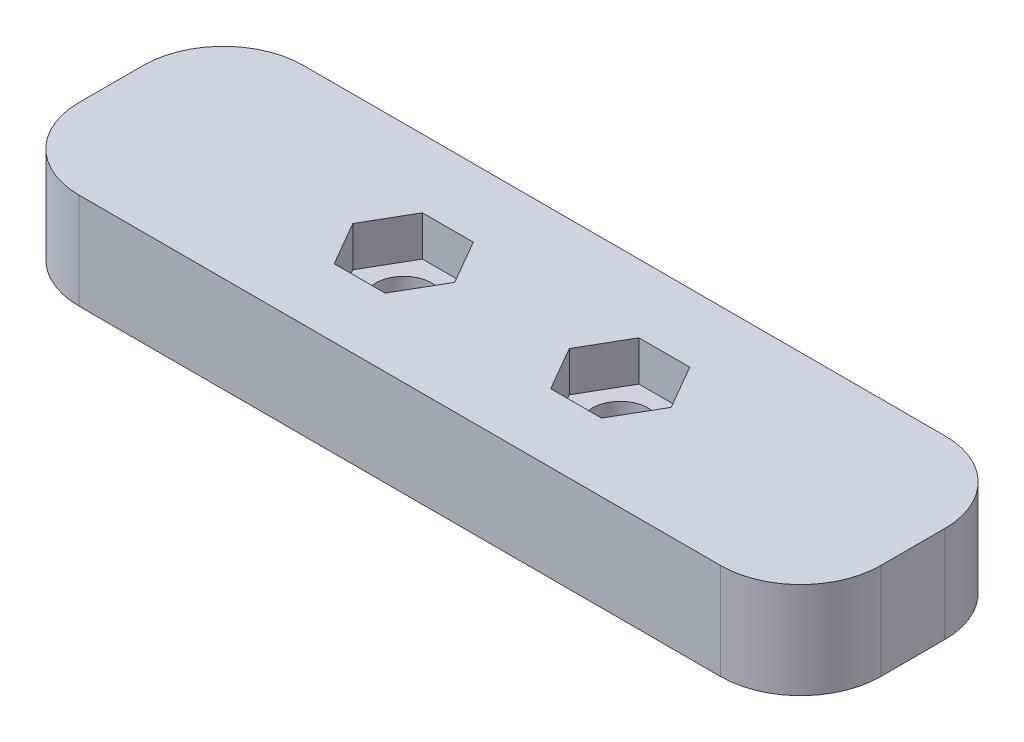
ISO-10303-21;
HEADER;
FILE_DESCRIPTION(('STEP AP214'),'2;1');
FILE_NAME('part.step','',(''),(''),'','','');
FILE_SCHEMA(('AUTOMOTIVE_DESIGN { 1 0 10303 214 1 1 1 1 }'));
ENDSEC;
DATA;
#1=APPLICATION_CONTEXT('core data for automotive mechanical design processes');
#2=APPLICATION_PROTOCOL_DEFINITION('international standard','automotive_design',2000,#1);
#3=PRODUCT_CONTEXT('',#1,'mechanical');
#4=PRODUCT('Part','Part','',(#3));
#5=PRODUCT_RELATED_PRODUCT_CATEGORY('part','',(#4));
#6=PRODUCT_DEFINITION_FORMATION('','',#4);
#7=PRODUCT_DEFINITION_CONTEXT('part definition',#1,'design');
#8=PRODUCT_DEFINITION('design','',#6,#7);
#9=PRODUCT_DEFINITION_SHAPE('','',#8);
#10=(LENGTH_UNIT() NAMED_UNIT(*) SI_UNIT(.MILLI.,.METRE.));
#11=(NAMED_UNIT(*) PLANE_ANGLE_UNIT() SI_UNIT($,.RADIAN.));
#12=(NAMED_UNIT(*) SI_UNIT($,.STERADIAN.) SOLID_ANGLE_UNIT());
#13=UNCERTAINTY_MEASURE_WITH_UNIT(LENGTH_MEASURE(1.E-05),#10,'distance_accuracy_value','');
#14=(GEOMETRIC_REPRESENTATION_CONTEXT(3) GLOBAL_UNCERTAINTY_ASSIGNED_CONTEXT((#13)) GLOBAL_UNIT_ASSIGNED_CONTEXT((#10,
#11,#12)) REPRESENTATION_CONTEXT('',''));
#15=CARTESIAN_POINT('',(0.,0.,0.));
#16=DIRECTION('',(0.,0.,1.));
#17=DIRECTION('',(1.,0.,0.));
#18=AXIS2_PLACEMENT_3D('',#15,#16,#17);
#19=CARTESIAN_POINT('',(18.25,6.,-7.));
#20=DIRECTION('',(0.,-1.,0.));
#21=DIRECTION('',(0.,0.,-1.));
#22=AXIS2_PLACEMENT_3D('',#19,#20,#21);
#23=CYLINDRICAL_SURFACE('',#22,1.75);
#24=CARTESIAN_POINT('',(18.25,0.,-7.));
#25=DIRECTION('',(0.,1.,0.));
#26=DIRECTION('',(0.,0.,1.));
#27=AXIS2_PLACEMENT_3D('',#24,#25,#26);
#28=CIRCLE('',#27,1.75);
#29=CARTESIAN_POINT('',(18.25,0.,-5.25));
#30=VERTEX_POINT('',#29);
#31=EDGE_CURVE('E276',#30,#30,#28,.T.);
#32=ORIENTED_EDGE('',*,*,#31,.F.);
#33=EDGE_LOOP('',(#32));
#34=FACE_BOUND('',#33,.T.);
#35=CARTESIAN_POINT('',(18.25,3.5,-7.));
#36=DIRECTION('',(0.,1.,0.));
#37=DIRECTION('',(0.,0.,1.));
#38=AXIS2_PLACEMENT_3D('',#35,#36,#37);
#39=CIRCLE('',#38,1.75);
#40=CARTESIAN_POINT('',(18.25,3.5,-5.25));
#41=VERTEX_POINT('',#40);
#42=EDGE_CURVE('E37',#41,#41,#39,.T.);
#43=ORIENTED_EDGE('',*,*,#42,.T.);
#44=EDGE_LOOP('',(#43));
#45=FACE_BOUND('',#44,.T.);
#46=ADVANCED_FACE('F33',(#34,#45),#23,.F.);
#47=CARTESIAN_POINT('',(31.75,6.,-7.));
#48=DIRECTION('',(0.,-1.,0.));
#49=DIRECTION('',(0.,0.,-1.));
#50=AXIS2_PLACEMENT_3D('',#47,#48,#49);
#51=CYLINDRICAL_SURFACE('',#50,1.75);
#52=CARTESIAN_POINT('',(31.75,0.,-7.));
#53=DIRECTION('',(0.,1.,0.));
#54=DIRECTION('',(0.,0.,1.));
#55=AXIS2_PLACEMENT_3D('',#52,#53,#54);
#56=CIRCLE('',#55,1.75);
#57=CARTESIAN_POINT('',(31.75,0.,-5.25));
#58=VERTEX_POINT('',#57);
#59=EDGE_CURVE('E273',#58,#58,#56,.T.);
#60=ORIENTED_EDGE('',*,*,#59,.F.);
#61=EDGE_LOOP('',(#60));
#62=FACE_BOUND('',#61,.T.);
#63=CARTESIAN_POINT('',(31.75,3.5,-7.));
#64=DIRECTION('',(0.,1.,0.));
#65=DIRECTION('',(0.,0.,1.));
#66=AXIS2_PLACEMENT_3D('',#63,#64,#65);
#67=CIRCLE('',#66,1.75);
#68=CARTESIAN_POINT('',(31.75,3.5,-5.25));
#69=VERTEX_POINT('',#68);
#70=EDGE_CURVE('E220',#69,#69,#67,.T.);
#71=ORIENTED_EDGE('',*,*,#70,.T.);
#72=EDGE_LOOP('',(#71));
#73=FACE_BOUND('',#72,.T.);
#74=ADVANCED_FACE('F348',(#62,#73),#51,.F.);
#75=CARTESIAN_POINT('',(5.,6.,-5.));
#76=DIRECTION('',(0.,1.,0.));
#77=DIRECTION('',(0.,0.,1.));
#78=AXIS2_PLACEMENT_3D('',#75,#76,#77);
#79=PLANE('',#78);
#80=DIRECTION('',(1.,0.,0.));
#81=VECTOR('',#80,1.);
#82=CARTESIAN_POINT('',(16.6622867597285,6.,-4.25));
#83=LINE('',#82,#81);
#84=CARTESIAN_POINT('',(16.6622867597285,6.,-4.25));
#85=VERTEX_POINT('',#84);
#86=CARTESIAN_POINT('',(19.8377132402715,6.,-4.25));
#87=VERTEX_POINT('',#86);
#88=EDGE_CURVE('E50',#85,#87,#83,.T.);
#89=ORIENTED_EDGE('',*,*,#88,.F.);
#90=DIRECTION('',(0.5,0.,0.866025403784439));
#91=VECTOR('',#90,1.);
#92=CARTESIAN_POINT('',(15.0745735194571,6.,-7.));
#93=LINE('',#92,#91);
#94=CARTESIAN_POINT('',(15.0745735194571,6.,-7.));
#95=VERTEX_POINT('',#94);
#96=EDGE_CURVE('E193',#95,#85,#93,.T.);
#97=ORIENTED_EDGE('',*,*,#96,.F.);
#98=DIRECTION('',(-0.5,0.,0.866025403784439));
#99=VECTOR('',#98,1.);
#100=CARTESIAN_POINT('',(16.6622867597285,6.,-9.75000000000001));
#101=LINE('',#100,#99);
#102=CARTESIAN_POINT('',(16.6622867597285,6.,-9.75000000000001));
#103=VERTEX_POINT('',#102);
#104=EDGE_CURVE('E196',#103,#95,#101,.T.);
#105=ORIENTED_EDGE('',*,*,#104,.F.);
#106=DIRECTION('',(-1.,0.,0.));
#107=VECTOR('',#106,1.);
#108=CARTESIAN_POINT('',(19.8377132402715,6.,-9.75000000000001));
#109=LINE('',#108,#107);
#110=CARTESIAN_POINT('',(19.8377132402715,6.,-9.75000000000001));
#111=VERTEX_POINT('',#110);
#112=EDGE_CURVE('E213',#111,#103,#109,.T.);
#113=ORIENTED_EDGE('',*,*,#112,.F.);
#114=DIRECTION('',(-0.5,0.,-0.866025403784439));
#115=VECTOR('',#114,1.);
#116=CARTESIAN_POINT('',(21.4254264805429,6.,-7.));
#117=LINE('',#116,#115);
#118=CARTESIAN_POINT('',(21.4254264805429,6.,-7.));
#119=VERTEX_POINT('',#118);
#120=EDGE_CURVE('E210',#119,#111,#117,.T.);
#121=ORIENTED_EDGE('',*,*,#120,.F.);
#122=DIRECTION('',(0.5,0.,-0.866025403784439));
#123=VECTOR('',#122,1.);
#124=CARTESIAN_POINT('',(19.8377132402715,6.,-4.25));
#125=LINE('',#124,#123);
#126=EDGE_CURVE('E207',#87,#119,#125,.T.);
#127=ORIENTED_EDGE('',*,*,#126,.F.);
#128=EDGE_LOOP('',(#89,#97,#105,#113,#121,#127));
#129=FACE_BOUND('',#128,.T.);
#130=DIRECTION('',(1.,0.,0.));
#131=VECTOR('',#130,1.);
#132=CARTESIAN_POINT('',(30.1622867597285,6.,-4.25));
#133=LINE('',#132,#131);
#134=CARTESIAN_POINT('',(30.1622867597285,6.,-4.25));
#135=VERTEX_POINT('',#134);
#136=CARTESIAN_POINT('',(33.3377132402715,6.,-4.25));
#137=VERTEX_POINT('',#136);
#138=EDGE_CURVE('E58',#135,#137,#133,.T.);
#139=ORIENTED_EDGE('',*,*,#138,.F.);
#140=DIRECTION('',(0.5,0.,0.866025403784439));
#141=VECTOR('',#140,1.);
#142=CARTESIAN_POINT('',(28.5745735194571,6.,-7.));
#143=LINE('',#142,#141);
#144=CARTESIAN_POINT('',(28.5745735194571,6.,-7.));
#145=VERTEX_POINT('',#144);
#146=EDGE_CURVE('E232',#145,#135,#143,.T.);
#147=ORIENTED_EDGE('',*,*,#146,.F.);
#148=DIRECTION('',(-0.5,0.,0.866025403784439));
#149=VECTOR('',#148,1.);
#150=CARTESIAN_POINT('',(30.1622867597285,6.,-9.75));
#151=LINE('',#150,#149);
#152=CARTESIAN_POINT('',(30.1622867597285,6.,-9.75));
#153=VERTEX_POINT('',#152);
#154=EDGE_CURVE('E258',#153,#145,#151,.T.);
#155=ORIENTED_EDGE('',*,*,#154,.F.);
#156=DIRECTION('',(-1.,0.,0.));
#157=VECTOR('',#156,1.);
#158=CARTESIAN_POINT('',(33.3377132402715,6.,-9.75));
#159=LINE('',#158,#157);
#160=CARTESIAN_POINT('',(33.3377132402715,6.,-9.75));
#161=VERTEX_POINT('',#160);
#162=EDGE_CURVE('E255',#161,#153,#159,.T.);
#163=ORIENTED_EDGE('',*,*,#162,.F.);
#164=DIRECTION('',(-0.500000000000001,0.,-0.866025403784438));
#165=VECTOR('',#164,1.);
#166=CARTESIAN_POINT('',(34.9254264805429,6.,-6.99999999999999));
#167=LINE('',#166,#165);
#168=CARTESIAN_POINT('',(34.9254264805429,6.,-6.99999999999999));
#169=VERTEX_POINT('',#168);
#170=EDGE_CURVE('E252',#169,#161,#167,.T.);
#171=ORIENTED_EDGE('',*,*,#170,.F.);
#172=DIRECTION('',(0.500000000000001,0.,-0.866025403784438));
#173=VECTOR('',#172,1.);
#174=CARTESIAN_POINT('',(33.3377132402715,6.,-4.25));
#175=LINE('',#174,#173);
#176=EDGE_CURVE('E249',#137,#169,#175,.T.);
#177=ORIENTED_EDGE('',*,*,#176,.F.);
#178=EDGE_LOOP('',(#139,#147,#155,#163,#171,#177));
#179=FACE_BOUND('',#178,.T.);
#180=CARTESIAN_POINT('',(5.,6.,-5.));
#181=DIRECTION('',(0.,1.,0.));
#182=DIRECTION('',(0.,0.,1.));
#183=AXIS2_PLACEMENT_3D('',#180,#181,#182);
#184=CIRCLE('',#183,5.);
#185=CARTESIAN_POINT('',(0.,6.,-5.00000000000004));
#186=VERTEX_POINT('',#185);
#187=CARTESIAN_POINT('',(5.00000000000004,6.,0.));
#188=VERTEX_POINT('',#187);
#189=EDGE_CURVE('E280',#186,#188,#184,.T.);
#190=ORIENTED_EDGE('',*,*,#189,.T.);
#191=DIRECTION('',(1.,0.,0.));
#192=VECTOR('',#191,1.);
#193=CARTESIAN_POINT('',(5.00000000000004,6.,0.));
#194=LINE('',#193,#192);
#195=CARTESIAN_POINT('',(45.,6.,0.));
#196=VERTEX_POINT('',#195);
#197=EDGE_CURVE('E283',#188,#196,#194,.T.);
#198=ORIENTED_EDGE('',*,*,#197,.T.);
#199=CARTESIAN_POINT('',(45.,6.,-5.));
#200=DIRECTION('',(0.,1.,0.));
#201=DIRECTION('',(0.,0.,-1.));
#202=AXIS2_PLACEMENT_3D('',#199,#200,#201);
#203=CIRCLE('',#202,5.);
#204=CARTESIAN_POINT('',(50.,6.,-5.00000000000004));
#205=VERTEX_POINT('',#204);
#206=EDGE_CURVE('E286',#196,#205,#203,.T.);
#207=ORIENTED_EDGE('',*,*,#206,.T.);
#208=DIRECTION('',(0.,0.,-1.));
#209=VECTOR('',#208,1.);
#210=CARTESIAN_POINT('',(50.,6.,-5.00000000000004));
#211=LINE('',#210,#209);
#212=CARTESIAN_POINT('',(50.,6.,-9.));
#213=VERTEX_POINT('',#212);
#214=EDGE_CURVE('E288',#205,#213,#211,.T.);
#215=ORIENTED_EDGE('',*,*,#214,.T.);
#216=CARTESIAN_POINT('',(45.,6.,-9.));
#217=DIRECTION('',(0.,1.,0.));
#218=DIRECTION('',(0.,0.,-1.));
#219=AXIS2_PLACEMENT_3D('',#216,#217,#218);
#220=CIRCLE('',#219,5.);
#221=CARTESIAN_POINT('',(45.,6.,-14.));
#222=VERTEX_POINT('',#221);
#223=EDGE_CURVE('E290',#213,#222,#220,.T.);
#224=ORIENTED_EDGE('',*,*,#223,.T.);
#225=DIRECTION('',(-1.,0.,0.));
#226=VECTOR('',#225,1.);
#227=CARTESIAN_POINT('',(5.,6.,-14.));
#228=LINE('',#227,#226);
#229=CARTESIAN_POINT('',(5.,6.,-14.));
#230=VERTEX_POINT('',#229);
#231=EDGE_CURVE('E292',#222,#230,#228,.T.);
#232=ORIENTED_EDGE('',*,*,#231,.T.);
#233=CARTESIAN_POINT('',(5.,6.,-9.));
#234=DIRECTION('',(0.,1.,0.));
#235=DIRECTION('',(0.,0.,-1.));
#236=AXIS2_PLACEMENT_3D('',#233,#234,#235);
#237=CIRCLE('',#236,5.);
#238=CARTESIAN_POINT('',(0.,6.,-9.));
#239=VERTEX_POINT('',#238);
#240=EDGE_CURVE('E294',#230,#239,#237,.T.);
#241=ORIENTED_EDGE('',*,*,#240,.T.);
#242=DIRECTION('',(0.,0.,1.));
#243=VECTOR('',#242,1.);
#244=CARTESIAN_POINT('',(0.,6.,-5.00000000000004));
#245=LINE('',#244,#243);
#246=EDGE_CURVE('E296',#239,#186,#245,.T.);
#247=ORIENTED_EDGE('',*,*,#246,.T.);
#248=EDGE_LOOP('',(#190,#198,#207,#215,#224,#232,#241,#247));
#249=FACE_BOUND('',#248,.T.);
#250=ADVANCED_FACE('F354',(#129,#179,#249),#79,.T.);
#251=CARTESIAN_POINT('',(5.,0.,-5.));
#252=DIRECTION('',(0.,1.,0.));
#253=DIRECTION('',(0.,0.,1.));
#254=AXIS2_PLACEMENT_3D('',#251,#252,#253);
#255=PLANE('',#254);
#256=CARTESIAN_POINT('',(5.,0.,-5.));
#257=DIRECTION('',(0.,1.,0.));
#258=DIRECTION('',(0.,0.,1.));
#259=AXIS2_PLACEMENT_3D('',#256,#257,#258);
#260=CIRCLE('',#259,5.);
#261=CARTESIAN_POINT('',(0.,0.,-5.00000000000004));
#262=VERTEX_POINT('',#261);
#263=CARTESIAN_POINT('',(5.00000000000004,0.,0.));
#264=VERTEX_POINT('',#263);
#265=EDGE_CURVE('E279',#262,#264,#260,.T.);
#266=ORIENTED_EDGE('',*,*,#265,.F.);
#267=DIRECTION('',(0.,0.,1.));
#268=VECTOR('',#267,1.);
#269=CARTESIAN_POINT('',(0.,0.,-5.00000000000004));
#270=LINE('',#269,#268);
#271=CARTESIAN_POINT('',(0.,0.,-9.));
#272=VERTEX_POINT('',#271);
#273=EDGE_CURVE('E284',#272,#262,#270,.T.);
#274=ORIENTED_EDGE('',*,*,#273,.F.);
#275=CARTESIAN_POINT('',(5.,0.,-9.));
#276=DIRECTION('',(0.,1.,0.));
#277=DIRECTION('',(0.,0.,-1.));
#278=AXIS2_PLACEMENT_3D('',#275,#276,#277);
#279=CIRCLE('',#278,5.);
#280=CARTESIAN_POINT('',(5.,0.,-14.));
#281=VERTEX_POINT('',#280);
#282=EDGE_CURVE('E311',#281,#272,#279,.T.);
#283=ORIENTED_EDGE('',*,*,#282,.F.);
#284=DIRECTION('',(-1.,0.,0.));
#285=VECTOR('',#284,1.);
#286=CARTESIAN_POINT('',(5.,0.,-14.));
#287=LINE('',#286,#285);
#288=CARTESIAN_POINT('',(45.,0.,-14.));
#289=VERTEX_POINT('',#288);
#290=EDGE_CURVE('E309',#289,#281,#287,.T.);
#291=ORIENTED_EDGE('',*,*,#290,.F.);
#292=CARTESIAN_POINT('',(45.,0.,-9.));
#293=DIRECTION('',(0.,1.,0.));
#294=DIRECTION('',(0.,0.,-1.));
#295=AXIS2_PLACEMENT_3D('',#292,#293,#294);
#296=CIRCLE('',#295,5.);
#297=CARTESIAN_POINT('',(50.,0.,-9.));
#298=VERTEX_POINT('',#297);
#299=EDGE_CURVE('E307',#298,#289,#296,.T.);
#300=ORIENTED_EDGE('',*,*,#299,.F.);
#301=DIRECTION('',(0.,0.,-1.));
#302=VECTOR('',#301,1.);
#303=CARTESIAN_POINT('',(50.,0.,-5.00000000000004));
#304=LINE('',#303,#302);
#305=CARTESIAN_POINT('',(50.,0.,-5.00000000000004));
#306=VERTEX_POINT('',#305);
#307=EDGE_CURVE('E305',#306,#298,#304,.T.);
#308=ORIENTED_EDGE('',*,*,#307,.F.);
#309=CARTESIAN_POINT('',(45.,0.,-5.));
#310=DIRECTION('',(0.,1.,0.));
#311=DIRECTION('',(0.,0.,-1.));
#312=AXIS2_PLACEMENT_3D('',#309,#310,#311);
#313=CIRCLE('',#312,5.);
#314=CARTESIAN_POINT('',(45.,0.,0.));
#315=VERTEX_POINT('',#314);
#316=EDGE_CURVE('E303',#315,#306,#313,.T.);
#317=ORIENTED_EDGE('',*,*,#316,.F.);
#318=DIRECTION('',(1.,0.,0.));
#319=VECTOR('',#318,1.);
#320=CARTESIAN_POINT('',(5.00000000000004,0.,0.));
#321=LINE('',#320,#319);
#322=EDGE_CURVE('E301',#264,#315,#321,.T.);
#323=ORIENTED_EDGE('',*,*,#322,.F.);
#324=EDGE_LOOP('',(#266,#274,#283,#291,#300,#308,#317,#323));
#325=FACE_BOUND('',#324,.T.);
#326=ORIENTED_EDGE('',*,*,#31,.T.);
#327=EDGE_LOOP('',(#326));
#328=FACE_BOUND('',#327,.T.);
#329=ORIENTED_EDGE('',*,*,#59,.T.);
#330=EDGE_LOOP('',(#329));
#331=FACE_BOUND('',#330,.T.);
#332=ADVANCED_FACE('F362',(#325,#328,#331),#255,.F.);
#333=CARTESIAN_POINT('',(5.,6.,-5.));
#334=DIRECTION('',(0.,-1.,0.));
#335=DIRECTION('',(0.,0.,-1.));
#336=AXIS2_PLACEMENT_3D('',#333,#334,#335);
#337=CYLINDRICAL_SURFACE('',#336,5.);
#338=ORIENTED_EDGE('',*,*,#265,.T.);
#339=DIRECTION('',(0.,-1.,0.));
#340=VECTOR('',#339,1.);
#341=CARTESIAN_POINT('',(5.00000000000004,6.,0.));
#342=LINE('',#341,#340);
#343=EDGE_CURVE('E11',#188,#264,#342,.T.);
#344=ORIENTED_EDGE('',*,*,#343,.F.);
#345=ORIENTED_EDGE('',*,*,#189,.F.);
#346=DIRECTION('',(0.,-1.,0.));
#347=VECTOR('',#346,1.);
#348=CARTESIAN_POINT('',(0.,6.,-5.00000000000004));
#349=LINE('',#348,#347);
#350=EDGE_CURVE('E298',#186,#262,#349,.T.);
#351=ORIENTED_EDGE('',*,*,#350,.T.);
#352=EDGE_LOOP('',(#338,#344,#345,#351));
#353=FACE_BOUND('',#352,.T.);
#354=ADVANCED_FACE('F35',(#353),#337,.T.);
#355=CARTESIAN_POINT('',(5.00000000000004,6.,0.));
#356=DIRECTION('',(0.,0.,-1.));
#357=DIRECTION('',(-1.,0.,0.));
#358=AXIS2_PLACEMENT_3D('',#355,#356,#357);
#359=PLANE('',#358);
#360=ORIENTED_EDGE('',*,*,#322,.T.);
#361=DIRECTION('',(0.,-1.,0.));
#362=VECTOR('',#361,1.);
#363=CARTESIAN_POINT('',(45.,6.,0.));
#364=LINE('',#363,#362);
#365=EDGE_CURVE('E42',#196,#315,#364,.T.);
#366=ORIENTED_EDGE('',*,*,#365,.F.);
#367=ORIENTED_EDGE('',*,*,#197,.F.);
#368=ORIENTED_EDGE('',*,*,#343,.T.);
#369=EDGE_LOOP('',(#360,#366,#367,#368));
#370=FACE_BOUND('',#369,.T.);
#371=ADVANCED_FACE('F390',(#370),#359,.F.);
#372=CARTESIAN_POINT('',(45.,6.,-5.));
#373=DIRECTION('',(0.,-1.,0.));
#374=DIRECTION('',(0.,0.,-1.));
#375=AXIS2_PLACEMENT_3D('',#372,#373,#374);
#376=CYLINDRICAL_SURFACE('',#375,5.);
#377=ORIENTED_EDGE('',*,*,#316,.T.);
#378=DIRECTION('',(0.,-1.,0.));
#379=VECTOR('',#378,1.);
#380=CARTESIAN_POINT('',(50.,6.,-5.00000000000004));
#381=LINE('',#380,#379);
#382=EDGE_CURVE('E328',#205,#306,#381,.T.);
#383=ORIENTED_EDGE('',*,*,#382,.F.);
#384=ORIENTED_EDGE('',*,*,#206,.F.);
#385=ORIENTED_EDGE('',*,*,#365,.T.);
#386=EDGE_LOOP('',(#377,#383,#384,#385));
#387=FACE_BOUND('',#386,.T.);
#388=ADVANCED_FACE('F387',(#387),#376,.T.);
#389=CARTESIAN_POINT('',(50.,6.,-5.00000000000004));
#390=DIRECTION('',(-1.,0.,0.));
#391=DIRECTION('',(0.,0.,1.));
#392=AXIS2_PLACEMENT_3D('',#389,#390,#391);
#393=PLANE('',#392);
#394=ORIENTED_EDGE('',*,*,#307,.T.);
#395=DIRECTION('',(0.,-1.,0.));
#396=VECTOR('',#395,1.);
#397=CARTESIAN_POINT('',(50.,6.,-9.));
#398=LINE('',#397,#396);
#399=EDGE_CURVE('E325',#213,#298,#398,.T.);
#400=ORIENTED_EDGE('',*,*,#399,.F.);
#401=ORIENTED_EDGE('',*,*,#214,.F.);
#402=ORIENTED_EDGE('',*,*,#382,.T.);
#403=EDGE_LOOP('',(#394,#400,#401,#402));
#404=FACE_BOUND('',#403,.T.);
#405=ADVANCED_FACE('F383',(#404),#393,.F.);
#406=CARTESIAN_POINT('',(45.,6.,-9.));
#407=DIRECTION('',(0.,-1.,0.));
#408=DIRECTION('',(0.,0.,-1.));
#409=AXIS2_PLACEMENT_3D('',#406,#407,#408);
#410=CYLINDRICAL_SURFACE('',#409,5.);
#411=ORIENTED_EDGE('',*,*,#299,.T.);
#412=DIRECTION('',(0.,-1.,0.));
#413=VECTOR('',#412,1.);
#414=CARTESIAN_POINT('',(45.,6.,-14.));
#415=LINE('',#414,#413);
#416=EDGE_CURVE('E322',#222,#289,#415,.T.);
#417=ORIENTED_EDGE('',*,*,#416,.F.);
#418=ORIENTED_EDGE('',*,*,#223,.F.);
#419=ORIENTED_EDGE('',*,*,#399,.T.);
#420=EDGE_LOOP('',(#411,#417,#418,#419));
#421=FACE_BOUND('',#420,.T.);
#422=ADVANCED_FACE('F379',(#421),#410,.T.);
#423=CARTESIAN_POINT('',(5.,6.,-14.));
#424=DIRECTION('',(0.,0.,1.));
#425=DIRECTION('',(1.,0.,0.));
#426=AXIS2_PLACEMENT_3D('',#423,#424,#425);
#427=PLANE('',#426);
#428=ORIENTED_EDGE('',*,*,#290,.T.);
#429=DIRECTION('',(0.,-1.,0.));
#430=VECTOR('',#429,1.);
#431=CARTESIAN_POINT('',(5.,6.,-14.));
#432=LINE('',#431,#430);
#433=EDGE_CURVE('E319',#230,#281,#432,.T.);
#434=ORIENTED_EDGE('',*,*,#433,.F.);
#435=ORIENTED_EDGE('',*,*,#231,.F.);
#436=ORIENTED_EDGE('',*,*,#416,.T.);
#437=EDGE_LOOP('',(#428,#434,#435,#436));
#438=FACE_BOUND('',#437,.T.);
#439=ADVANCED_FACE('F375',(#438),#427,.F.);
#440=CARTESIAN_POINT('',(5.,6.,-9.));
#441=DIRECTION('',(0.,-1.,0.));
#442=DIRECTION('',(0.,0.,-1.));
#443=AXIS2_PLACEMENT_3D('',#440,#441,#442);
#444=CYLINDRICAL_SURFACE('',#443,5.);
#445=ORIENTED_EDGE('',*,*,#282,.T.);
#446=DIRECTION('',(0.,-1.,0.));
#447=VECTOR('',#446,1.);
#448=CARTESIAN_POINT('',(0.,6.,-9.));
#449=LINE('',#448,#447);
#450=EDGE_CURVE('E316',#239,#272,#449,.T.);
#451=ORIENTED_EDGE('',*,*,#450,.F.);
#452=ORIENTED_EDGE('',*,*,#240,.F.);
#453=ORIENTED_EDGE('',*,*,#433,.T.);
#454=EDGE_LOOP('',(#445,#451,#452,#453));
#455=FACE_BOUND('',#454,.T.);
#456=ADVANCED_FACE('F371',(#455),#444,.T.);
#457=CARTESIAN_POINT('',(0.,6.,-5.00000000000004));
#458=DIRECTION('',(1.,0.,0.));
#459=DIRECTION('',(0.,0.,-1.));
#460=AXIS2_PLACEMENT_3D('',#457,#458,#459);
#461=PLANE('',#460);
#462=ORIENTED_EDGE('',*,*,#273,.T.);
#463=ORIENTED_EDGE('',*,*,#350,.F.);
#464=ORIENTED_EDGE('',*,*,#246,.F.);
#465=ORIENTED_EDGE('',*,*,#450,.T.);
#466=EDGE_LOOP('',(#462,#463,#464,#465));
#467=FACE_BOUND('',#466,.T.);
#468=ADVANCED_FACE('F367',(#467),#461,.F.);
#469=CARTESIAN_POINT('',(30.1622867597285,3.5,-4.25));
#470=DIRECTION('',(0.,0.,1.));
#471=DIRECTION('',(1.,0.,0.));
#472=AXIS2_PLACEMENT_3D('',#469,#470,#471);
#473=PLANE('',#472);
#474=ORIENTED_EDGE('',*,*,#138,.T.);
#475=DIRECTION('',(0.,1.,0.));
#476=VECTOR('',#475,1.);
#477=CARTESIAN_POINT('',(33.3377132402715,3.5,-4.25));
#478=LINE('',#477,#476);
#479=CARTESIAN_POINT('',(33.3377132402715,3.5,-4.25));
#480=VERTEX_POINT('',#479);
#481=EDGE_CURVE('E247',#480,#137,#478,.T.);
#482=ORIENTED_EDGE('',*,*,#481,.F.);
#483=DIRECTION('',(1.,0.,0.));
#484=VECTOR('',#483,1.);
#485=CARTESIAN_POINT('',(30.1622867597285,3.5,-4.25));
#486=LINE('',#485,#484);
#487=CARTESIAN_POINT('',(30.1622867597285,3.5,-4.25));
#488=VERTEX_POINT('',#487);
#489=EDGE_CURVE('E228',#488,#480,#486,.T.);
#490=ORIENTED_EDGE('',*,*,#489,.F.);
#491=DIRECTION('',(0.,1.,0.));
#492=VECTOR('',#491,1.);
#493=CARTESIAN_POINT('',(30.1622867597285,3.5,-4.25));
#494=LINE('',#493,#492);
#495=EDGE_CURVE('E208',#488,#135,#494,.T.);
#496=ORIENTED_EDGE('',*,*,#495,.T.);
#497=EDGE_LOOP('',(#474,#482,#490,#496));
#498=FACE_BOUND('',#497,.T.);
#499=ADVANCED_FACE('F370',(#498),#473,.F.);
#500=CARTESIAN_POINT('',(28.5745735194571,3.5,-7.));
#501=DIRECTION('',(-0.866025403784439,0.,0.5));
#502=DIRECTION('',(0.5,0.,0.866025403784439));
#503=AXIS2_PLACEMENT_3D('',#500,#501,#502);
#504=PLANE('',#503);
#505=ORIENTED_EDGE('',*,*,#146,.T.);
#506=ORIENTED_EDGE('',*,*,#495,.F.);
#507=DIRECTION('',(0.5,0.,0.866025403784439));
#508=VECTOR('',#507,1.);
#509=CARTESIAN_POINT('',(28.5745735194571,3.5,-7.));
#510=LINE('',#509,#508);
#511=CARTESIAN_POINT('',(28.5745735194571,3.5,-7.));
#512=VERTEX_POINT('',#511);
#513=EDGE_CURVE('E244',#512,#488,#510,.T.);
#514=ORIENTED_EDGE('',*,*,#513,.F.);
#515=DIRECTION('',(0.,1.,0.));
#516=VECTOR('',#515,1.);
#517=CARTESIAN_POINT('',(28.5745735194571,3.5,-7.));
#518=LINE('',#517,#516);
#519=EDGE_CURVE('E264',#512,#145,#518,.T.);
#520=ORIENTED_EDGE('',*,*,#519,.T.);
#521=EDGE_LOOP('',(#505,#506,#514,#520));
#522=FACE_BOUND('',#521,.T.);
#523=ADVANCED_FACE('F497',(#522),#504,.F.);
#524=CARTESIAN_POINT('',(30.1622867597285,3.5,-9.75));
#525=DIRECTION('',(-0.866025403784438,0.,-0.5));
#526=DIRECTION('',(-0.5,0.,0.866025403784439));
#527=AXIS2_PLACEMENT_3D('',#524,#525,#526);
#528=PLANE('',#527);
#529=ORIENTED_EDGE('',*,*,#154,.T.);
#530=ORIENTED_EDGE('',*,*,#519,.F.);
#531=DIRECTION('',(-0.5,0.,0.866025403784439));
#532=VECTOR('',#531,1.);
#533=CARTESIAN_POINT('',(30.1622867597285,3.5,-9.75));
#534=LINE('',#533,#532);
#535=CARTESIAN_POINT('',(30.1622867597285,3.5,-9.75));
#536=VERTEX_POINT('',#535);
#537=EDGE_CURVE('E241',#536,#512,#534,.T.);
#538=ORIENTED_EDGE('',*,*,#537,.F.);
#539=DIRECTION('',(0.,1.,0.));
#540=VECTOR('',#539,1.);
#541=CARTESIAN_POINT('',(30.1622867597285,3.5,-9.75));
#542=LINE('',#541,#540);
#543=EDGE_CURVE('E266',#536,#153,#542,.T.);
#544=ORIENTED_EDGE('',*,*,#543,.T.);
#545=EDGE_LOOP('',(#529,#530,#538,#544));
#546=FACE_BOUND('',#545,.T.);
#547=ADVANCED_FACE('F502',(#546),#528,.F.);
#548=CARTESIAN_POINT('',(33.3377132402715,3.5,-9.75));
#549=DIRECTION('',(0.,0.,-1.));
#550=DIRECTION('',(-1.,0.,0.));
#551=AXIS2_PLACEMENT_3D('',#548,#549,#550);
#552=PLANE('',#551);
#553=ORIENTED_EDGE('',*,*,#162,.T.);
#554=ORIENTED_EDGE('',*,*,#543,.F.);
#555=DIRECTION('',(-1.,0.,0.));
#556=VECTOR('',#555,1.);
#557=CARTESIAN_POINT('',(33.3377132402715,3.5,-9.75));
#558=LINE('',#557,#556);
#559=CARTESIAN_POINT('',(33.3377132402715,3.5,-9.75));
#560=VERTEX_POINT('',#559);
#561=EDGE_CURVE('E238',#560,#536,#558,.T.);
#562=ORIENTED_EDGE('',*,*,#561,.F.);
#563=DIRECTION('',(0.,1.,0.));
#564=VECTOR('',#563,1.);
#565=CARTESIAN_POINT('',(33.3377132402715,3.5,-9.75));
#566=LINE('',#565,#564);
#567=EDGE_CURVE('E268',#560,#161,#566,.T.);
#568=ORIENTED_EDGE('',*,*,#567,.T.);
#569=EDGE_LOOP('',(#553,#554,#562,#568));
#570=FACE_BOUND('',#569,.T.);
#571=ADVANCED_FACE('F510',(#570),#552,.F.);
#572=CARTESIAN_POINT('',(34.9254264805429,3.5,-6.99999999999999));
#573=DIRECTION('',(0.866025403784438,0.,-0.500000000000001));
#574=DIRECTION('',(-0.500000000000001,0.,-0.866025403784438));
#575=AXIS2_PLACEMENT_3D('',#572,#573,#574);
#576=PLANE('',#575);
#577=ORIENTED_EDGE('',*,*,#170,.T.);
#578=ORIENTED_EDGE('',*,*,#567,.F.);
#579=DIRECTION('',(-0.500000000000001,0.,-0.866025403784438));
#580=VECTOR('',#579,1.);
#581=CARTESIAN_POINT('',(34.9254264805429,3.5,-6.99999999999999));
#582=LINE('',#581,#580);
#583=CARTESIAN_POINT('',(34.9254264805429,3.5,-6.99999999999999));
#584=VERTEX_POINT('',#583);
#585=EDGE_CURVE('E235',#584,#560,#582,.T.);
#586=ORIENTED_EDGE('',*,*,#585,.F.);
#587=DIRECTION('',(0.,1.,0.));
#588=VECTOR('',#587,1.);
#589=CARTESIAN_POINT('',(34.9254264805429,3.5,-6.99999999999999));
#590=LINE('',#589,#588);
#591=EDGE_CURVE('E270',#584,#169,#590,.T.);
#592=ORIENTED_EDGE('',*,*,#591,.T.);
#593=EDGE_LOOP('',(#577,#578,#586,#592));
#594=FACE_BOUND('',#593,.T.);
#595=ADVANCED_FACE('F518',(#594),#576,.F.);
#596=CARTESIAN_POINT('',(33.3377132402715,3.5,-4.25));
#597=DIRECTION('',(0.866025403784438,0.,0.500000000000001));
#598=DIRECTION('',(0.500000000000001,0.,-0.866025403784438));
#599=AXIS2_PLACEMENT_3D('',#596,#597,#598);
#600=PLANE('',#599);
#601=ORIENTED_EDGE('',*,*,#176,.T.);
#602=ORIENTED_EDGE('',*,*,#591,.F.);
#603=DIRECTION('',(0.500000000000001,0.,-0.866025403784438));
#604=VECTOR('',#603,1.);
#605=CARTESIAN_POINT('',(33.3377132402715,3.5,-4.25));
#606=LINE('',#605,#604);
#607=EDGE_CURVE('E231',#480,#584,#606,.T.);
#608=ORIENTED_EDGE('',*,*,#607,.F.);
#609=ORIENTED_EDGE('',*,*,#481,.T.);
#610=EDGE_LOOP('',(#601,#602,#608,#609));
#611=FACE_BOUND('',#610,.T.);
#612=ADVANCED_FACE('F526',(#611),#600,.F.);
#613=CARTESIAN_POINT('',(0.,3.5,0.));
#614=DIRECTION('',(0.,1.,0.));
#615=DIRECTION('',(0.,0.,1.));
#616=AXIS2_PLACEMENT_3D('',#613,#614,#615);
#617=PLANE('',#616);
#618=ORIENTED_EDGE('',*,*,#70,.F.);
#619=EDGE_LOOP('',(#618));
#620=FACE_BOUND('',#619,.T.);
#621=ORIENTED_EDGE('',*,*,#489,.T.);
#622=ORIENTED_EDGE('',*,*,#607,.T.);
#623=ORIENTED_EDGE('',*,*,#585,.T.);
#624=ORIENTED_EDGE('',*,*,#561,.T.);
#625=ORIENTED_EDGE('',*,*,#537,.T.);
#626=ORIENTED_EDGE('',*,*,#513,.T.);
#627=EDGE_LOOP('',(#621,#622,#623,#624,#625,#626));
#628=FACE_BOUND('',#627,.T.);
#629=ADVANCED_FACE('F534',(#620,#628),#617,.T.);
#630=CARTESIAN_POINT('',(16.6622867597285,3.5,-4.25));
#631=DIRECTION('',(0.,0.,1.));
#632=DIRECTION('',(1.,0.,0.));
#633=AXIS2_PLACEMENT_3D('',#630,#631,#632);
#634=PLANE('',#633);
#635=ORIENTED_EDGE('',*,*,#88,.T.);
#636=DIRECTION('',(0.,1.,0.));
#637=VECTOR('',#636,1.);
#638=CARTESIAN_POINT('',(19.8377132402715,3.5,-4.25));
#639=LINE('',#638,#637);
#640=CARTESIAN_POINT('',(19.8377132402715,3.5,-4.25));
#641=VERTEX_POINT('',#640);
#642=EDGE_CURVE('E170',#641,#87,#639,.T.);
#643=ORIENTED_EDGE('',*,*,#642,.F.);
#644=DIRECTION('',(1.,0.,0.));
#645=VECTOR('',#644,1.);
#646=CARTESIAN_POINT('',(16.6622867597285,3.5,-4.25));
#647=LINE('',#646,#645);
#648=CARTESIAN_POINT('',(16.6622867597285,3.5,-4.25));
#649=VERTEX_POINT('',#648);
#650=EDGE_CURVE('E174',#649,#641,#647,.T.);
#651=ORIENTED_EDGE('',*,*,#650,.F.);
#652=DIRECTION('',(0.,1.,0.));
#653=VECTOR('',#652,1.);
#654=CARTESIAN_POINT('',(16.6622867597285,3.5,-4.25));
#655=LINE('',#654,#653);
#656=EDGE_CURVE('E218',#649,#85,#655,.T.);
#657=ORIENTED_EDGE('',*,*,#656,.T.);
#658=EDGE_LOOP('',(#635,#643,#651,#657));
#659=FACE_BOUND('',#658,.T.);
#660=ADVANCED_FACE('F172',(#659),#634,.F.);
#661=CARTESIAN_POINT('',(15.0745735194571,3.5,-7.));
#662=DIRECTION('',(-0.866025403784439,0.,0.5));
#663=DIRECTION('',(0.5,0.,0.866025403784439));
#664=AXIS2_PLACEMENT_3D('',#661,#662,#663);
#665=PLANE('',#664);
#666=ORIENTED_EDGE('',*,*,#96,.T.);
#667=ORIENTED_EDGE('',*,*,#656,.F.);
#668=DIRECTION('',(0.5,0.,0.866025403784439));
#669=VECTOR('',#668,1.);
#670=CARTESIAN_POINT('',(15.0745735194571,3.5,-7.));
#671=LINE('',#670,#669);
#672=CARTESIAN_POINT('',(15.0745735194571,3.5,-7.));
#673=VERTEX_POINT('',#672);
#674=EDGE_CURVE('E180',#673,#649,#671,.T.);
#675=ORIENTED_EDGE('',*,*,#674,.F.);
#676=DIRECTION('',(0.,1.,0.));
#677=VECTOR('',#676,1.);
#678=CARTESIAN_POINT('',(15.0745735194571,3.5,-7.));
#679=LINE('',#678,#677);
#680=EDGE_CURVE('E221',#673,#95,#679,.T.);
#681=ORIENTED_EDGE('',*,*,#680,.T.);
#682=EDGE_LOOP('',(#666,#667,#675,#681));
#683=FACE_BOUND('',#682,.T.);
#684=ADVANCED_FACE('F549',(#683),#665,.F.);
#685=CARTESIAN_POINT('',(16.6622867597285,3.5,-9.75000000000001));
#686=DIRECTION('',(-0.866025403784439,0.,-0.5));
#687=DIRECTION('',(-0.5,0.,0.866025403784439));
#688=AXIS2_PLACEMENT_3D('',#685,#686,#687);
#689=PLANE('',#688);
#690=ORIENTED_EDGE('',*,*,#104,.T.);
#691=ORIENTED_EDGE('',*,*,#680,.F.);
#692=DIRECTION('',(-0.5,0.,0.866025403784439));
#693=VECTOR('',#692,1.);
#694=CARTESIAN_POINT('',(16.6622867597285,3.5,-9.75000000000001));
#695=LINE('',#694,#693);
#696=CARTESIAN_POINT('',(16.6622867597285,3.5,-9.75000000000001));
#697=VERTEX_POINT('',#696);
#698=EDGE_CURVE('E203',#697,#673,#695,.T.);
#699=ORIENTED_EDGE('',*,*,#698,.F.);
#700=DIRECTION('',(0.,1.,0.));
#701=VECTOR('',#700,1.);
#702=CARTESIAN_POINT('',(16.6622867597285,3.5,-9.75000000000001));
#703=LINE('',#702,#701);
#704=EDGE_CURVE('E223',#697,#103,#703,.T.);
#705=ORIENTED_EDGE('',*,*,#704,.T.);
#706=EDGE_LOOP('',(#690,#691,#699,#705));
#707=FACE_BOUND('',#706,.T.);
#708=ADVANCED_FACE('F556',(#707),#689,.F.);
#709=CARTESIAN_POINT('',(19.8377132402715,3.5,-9.75000000000001));
#710=DIRECTION('',(0.,0.,-1.));
#711=DIRECTION('',(-1.,0.,0.));
#712=AXIS2_PLACEMENT_3D('',#709,#710,#711);
#713=PLANE('',#712);
#714=ORIENTED_EDGE('',*,*,#112,.T.);
#715=ORIENTED_EDGE('',*,*,#704,.F.);
#716=DIRECTION('',(-1.,0.,0.));
#717=VECTOR('',#716,1.);
#718=CARTESIAN_POINT('',(19.8377132402715,3.5,-9.75000000000001));
#719=LINE('',#718,#717);
#720=CARTESIAN_POINT('',(19.8377132402715,3.5,-9.75000000000001));
#721=VERTEX_POINT('',#720);
#722=EDGE_CURVE('E200',#721,#697,#719,.T.);
#723=ORIENTED_EDGE('',*,*,#722,.F.);
#724=DIRECTION('',(0.,1.,0.));
#725=VECTOR('',#724,1.);
#726=CARTESIAN_POINT('',(19.8377132402715,3.5,-9.75000000000001));
#727=LINE('',#726,#725);
#728=EDGE_CURVE('E225',#721,#111,#727,.T.);
#729=ORIENTED_EDGE('',*,*,#728,.T.);
#730=EDGE_LOOP('',(#714,#715,#723,#729));
#731=FACE_BOUND('',#730,.T.);
#732=ADVANCED_FACE('F563',(#731),#713,.F.);
#733=CARTESIAN_POINT('',(21.4254264805429,3.5,-7.));
#734=DIRECTION('',(0.866025403784439,0.,-0.5));
#735=DIRECTION('',(-0.5,0.,-0.866025403784439));
#736=AXIS2_PLACEMENT_3D('',#733,#734,#735);
#737=PLANE('',#736);
#738=ORIENTED_EDGE('',*,*,#120,.T.);
#739=ORIENTED_EDGE('',*,*,#728,.F.);
#740=DIRECTION('',(-0.5,0.,-0.866025403784439));
#741=VECTOR('',#740,1.);
#742=CARTESIAN_POINT('',(21.4254264805429,3.5,-7.));
#743=LINE('',#742,#741);
#744=CARTESIAN_POINT('',(21.4254264805429,3.5,-7.));
#745=VERTEX_POINT('',#744);
#746=EDGE_CURVE('E188',#745,#721,#743,.T.);
#747=ORIENTED_EDGE('',*,*,#746,.F.);
#748=DIRECTION('',(0.,1.,0.));
#749=VECTOR('',#748,1.);
#750=CARTESIAN_POINT('',(21.4254264805429,3.5,-7.));
#751=LINE('',#750,#749);
#752=EDGE_CURVE('E179',#745,#119,#751,.T.);
#753=ORIENTED_EDGE('',*,*,#752,.T.);
#754=EDGE_LOOP('',(#738,#739,#747,#753));
#755=FACE_BOUND('',#754,.T.);
#756=ADVANCED_FACE('F344',(#755),#737,.F.);
#757=CARTESIAN_POINT('',(19.8377132402715,3.5,-4.25));
#758=DIRECTION('',(0.866025403784439,0.,0.5));
#759=DIRECTION('',(0.5,0.,-0.866025403784439));
#760=AXIS2_PLACEMENT_3D('',#757,#758,#759);
#761=PLANE('',#760);
#762=ORIENTED_EDGE('',*,*,#126,.T.);
#763=ORIENTED_EDGE('',*,*,#752,.F.);
#764=DIRECTION('',(0.5,0.,-0.866025403784439));
#765=VECTOR('',#764,1.);
#766=CARTESIAN_POINT('',(19.8377132402715,3.5,-4.25));
#767=LINE('',#766,#765);
#768=EDGE_CURVE('E183',#641,#745,#767,.T.);
#769=ORIENTED_EDGE('',*,*,#768,.F.);
#770=ORIENTED_EDGE('',*,*,#642,.T.);
#771=EDGE_LOOP('',(#762,#763,#769,#770));
#772=FACE_BOUND('',#771,.T.);
#773=ADVANCED_FACE('F184',(#772),#761,.F.);
#774=CARTESIAN_POINT('',(0.,3.5,0.));
#775=DIRECTION('',(0.,1.,0.));
#776=DIRECTION('',(0.,0.,1.));
#777=AXIS2_PLACEMENT_3D('',#774,#775,#776);
#778=PLANE('',#777);
#779=ORIENTED_EDGE('',*,*,#42,.F.);
#780=EDGE_LOOP('',(#779));
#781=FACE_BOUND('',#780,.T.);
#782=ORIENTED_EDGE('',*,*,#650,.T.);
#783=ORIENTED_EDGE('',*,*,#768,.T.);
#784=ORIENTED_EDGE('',*,*,#746,.T.);
#785=ORIENTED_EDGE('',*,*,#722,.T.);
#786=ORIENTED_EDGE('',*,*,#698,.T.);
#787=ORIENTED_EDGE('',*,*,#674,.T.);
#788=EDGE_LOOP('',(#782,#783,#784,#785,#786,#787));
#789=FACE_BOUND('',#788,.T.);
#790=ADVANCED_FACE('F190',(#781,#789),#778,.T.);
#791=CLOSED_SHELL('',(#46,#74,#250,#332,#354,#371,#388,#405,#422,#439,#456,#468,#499,#523,#547,
#571,#595,#612,#629,#660,#684,#708,#732,#756,#773,#790));
#792=MANIFOLD_SOLID_BREP('B2',#791);
#793=ADVANCED_BREP_SHAPE_REPRESENTATION('',(#18,#792),#14);
#794=SHAPE_DEFINITION_REPRESENTATION(#9,#793);
ENDSEC;
END-ISO-10303-21;
